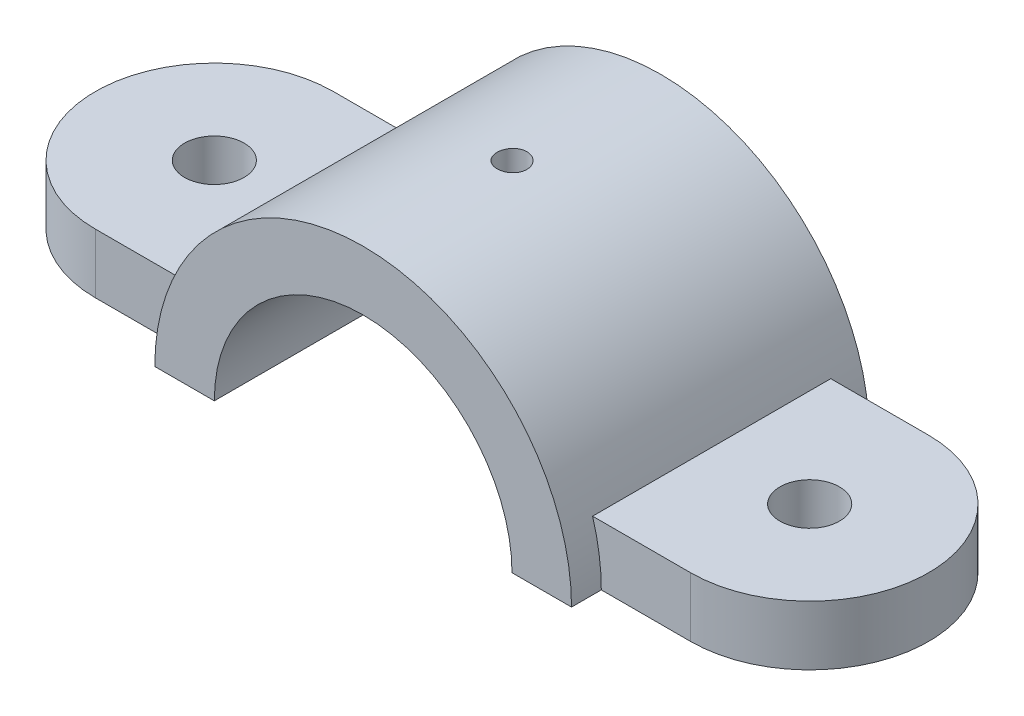
ISO-10303-21;
HEADER;
FILE_DESCRIPTION(('STEP AP214'),'2;1');
FILE_NAME('part.step','',(''),(''),'','','');
FILE_SCHEMA(('AUTOMOTIVE_DESIGN { 1 0 10303 214 1 1 1 1 }'));
ENDSEC;
DATA;
#1=APPLICATION_CONTEXT('core data for automotive mechanical design processes');
#2=APPLICATION_PROTOCOL_DEFINITION('international standard','automotive_design',2000,#1);
#3=PRODUCT_CONTEXT('',#1,'mechanical');
#4=PRODUCT('Part','Part','',(#3));
#5=PRODUCT_RELATED_PRODUCT_CATEGORY('part','',(#4));
#6=PRODUCT_DEFINITION_FORMATION('','',#4);
#7=PRODUCT_DEFINITION_CONTEXT('part definition',#1,'design');
#8=PRODUCT_DEFINITION('design','',#6,#7);
#9=PRODUCT_DEFINITION_SHAPE('','',#8);
#10=(LENGTH_UNIT() NAMED_UNIT(*) SI_UNIT(.MILLI.,.METRE.));
#11=(NAMED_UNIT(*) PLANE_ANGLE_UNIT() SI_UNIT($,.RADIAN.));
#12=(NAMED_UNIT(*) SI_UNIT($,.STERADIAN.) SOLID_ANGLE_UNIT());
#13=UNCERTAINTY_MEASURE_WITH_UNIT(LENGTH_MEASURE(1.E-05),#10,'distance_accuracy_value','');
#14=(GEOMETRIC_REPRESENTATION_CONTEXT(3) GLOBAL_UNCERTAINTY_ASSIGNED_CONTEXT((#13)) GLOBAL_UNIT_ASSIGNED_CONTEXT((#10,
#11,#12)) REPRESENTATION_CONTEXT('',''));
#15=CARTESIAN_POINT('',(0.,0.,0.));
#16=DIRECTION('',(0.,0.,1.));
#17=DIRECTION('',(1.,0.,0.));
#18=AXIS2_PLACEMENT_3D('',#15,#16,#17);
#19=CARTESIAN_POINT('',(0.,0.,31.75));
#20=DIRECTION('',(0.,0.,-1.));
#21=DIRECTION('',(-1.,0.,0.));
#22=AXIS2_PLACEMENT_3D('',#19,#20,#21);
#23=CYLINDRICAL_SURFACE('',#22,44.45);
#24=DIRECTION('',(0.,0.,-1.));
#25=VECTOR('',#24,1.);
#26=CARTESIAN_POINT('',(-42.597094971371,12.7,31.75));
#27=LINE('',#26,#25);
#28=CARTESIAN_POINT('',(-42.597094971371,12.7,25.4));
#29=VERTEX_POINT('',#28);
#30=CARTESIAN_POINT('',(-42.597094971371,12.7,-25.4));
#31=VERTEX_POINT('',#30);
#32=EDGE_CURVE('E169',#29,#31,#27,.T.);
#33=ORIENTED_EDGE('',*,*,#32,.F.);
#34=CARTESIAN_POINT('',(0.,0.,25.4));
#35=DIRECTION('',(0.,0.,-1.));
#36=DIRECTION('',(-1.,0.,0.));
#37=AXIS2_PLACEMENT_3D('',#34,#35,#36);
#38=CIRCLE('',#37,44.45);
#39=CARTESIAN_POINT('',(-44.45,0.,25.4));
#40=VERTEX_POINT('',#39);
#41=EDGE_CURVE('E170',#29,#40,#38,.F.);
#42=ORIENTED_EDGE('',*,*,#41,.T.);
#43=DIRECTION('',(0.,0.,-1.));
#44=VECTOR('',#43,1.);
#45=CARTESIAN_POINT('',(-44.45,0.,31.75));
#46=LINE('',#45,#44);
#47=CARTESIAN_POINT('',(-44.45,0.,31.75));
#48=VERTEX_POINT('',#47);
#49=EDGE_CURVE('E162',#48,#40,#46,.T.);
#50=ORIENTED_EDGE('',*,*,#49,.F.);
#51=CARTESIAN_POINT('',(0.,0.,31.75));
#52=DIRECTION('',(0.,0.,1.));
#53=DIRECTION('',(1.,0.,0.));
#54=AXIS2_PLACEMENT_3D('',#51,#52,#53);
#55=CIRCLE('',#54,44.45);
#56=CARTESIAN_POINT('',(44.45,0.,31.75));
#57=VERTEX_POINT('',#56);
#58=EDGE_CURVE('E153',#57,#48,#55,.T.);
#59=ORIENTED_EDGE('',*,*,#58,.F.);
#60=DIRECTION('',(0.,0.,-1.));
#61=VECTOR('',#60,1.);
#62=CARTESIAN_POINT('',(44.45,0.,31.75));
#63=LINE('',#62,#61);
#64=CARTESIAN_POINT('',(44.45,0.,25.4));
#65=VERTEX_POINT('',#64);
#66=EDGE_CURVE('E157',#57,#65,#63,.T.);
#67=ORIENTED_EDGE('',*,*,#66,.T.);
#68=CARTESIAN_POINT('',(42.597094971371,12.7,25.4));
#69=VERTEX_POINT('',#68);
#70=EDGE_CURVE('E166',#65,#69,#38,.F.);
#71=ORIENTED_EDGE('',*,*,#70,.T.);
#72=DIRECTION('',(0.,0.,-1.));
#73=VECTOR('',#72,1.);
#74=CARTESIAN_POINT('',(42.597094971371,12.7,31.75));
#75=LINE('',#74,#73);
#76=CARTESIAN_POINT('',(42.597094971371,12.7,-25.4));
#77=VERTEX_POINT('',#76);
#78=EDGE_CURVE('E61',#77,#69,#75,.F.);
#79=ORIENTED_EDGE('',*,*,#78,.F.);
#80=CARTESIAN_POINT('',(0.,0.,-25.4));
#81=DIRECTION('',(0.,0.,1.));
#82=DIRECTION('',(1.,0.,0.));
#83=AXIS2_PLACEMENT_3D('',#80,#81,#82);
#84=CIRCLE('',#83,44.45);
#85=CARTESIAN_POINT('',(44.45,0.,-25.4));
#86=VERTEX_POINT('',#85);
#87=EDGE_CURVE('E46',#77,#86,#84,.F.);
#88=ORIENTED_EDGE('',*,*,#87,.T.);
#89=CARTESIAN_POINT('',(44.45,0.,-31.75));
#90=VERTEX_POINT('',#89);
#91=EDGE_CURVE('E161',#86,#90,#63,.T.);
#92=ORIENTED_EDGE('',*,*,#91,.T.);
#93=CARTESIAN_POINT('',(0.,0.,-31.75));
#94=DIRECTION('',(0.,0.,1.));
#95=DIRECTION('',(1.,0.,0.));
#96=AXIS2_PLACEMENT_3D('',#93,#94,#95);
#97=CIRCLE('',#96,44.45);
#98=CARTESIAN_POINT('',(-44.45,0.,-31.75));
#99=VERTEX_POINT('',#98);
#100=EDGE_CURVE('E150',#90,#99,#97,.T.);
#101=ORIENTED_EDGE('',*,*,#100,.T.);
#102=CARTESIAN_POINT('',(-44.45,0.,-25.4));
#103=VERTEX_POINT('',#102);
#104=EDGE_CURVE('E160',#103,#99,#46,.T.);
#105=ORIENTED_EDGE('',*,*,#104,.F.);
#106=EDGE_CURVE('E11',#103,#31,#84,.F.);
#107=ORIENTED_EDGE('',*,*,#106,.T.);
#108=EDGE_LOOP('',(#33,#42,#50,#59,#67,#71,#79,#88,#92,#101,#105,#107));
#109=FACE_BOUND('',#108,.T.);
#110=CARTESIAN_POINT('',(0.,44.45,-3.175));
#111=CARTESIAN_POINT('',(-0.17809755969062,44.4499985010204,-3.1749921852915));
#112=CARTESIAN_POINT('',(-0.356318460938591,44.4489181935322,-3.15996439283335));
#113=CARTESIAN_POINT('',(-0.707835270978346,44.4447124952987,-3.10023344384522));
#114=CARTESIAN_POINT('',(-0.88112526755611,44.4415847492453,-3.05549610954538));
#115=CARTESIAN_POINT('',(-1.217637916744,44.4336378558182,-2.9376410589189));
#116=CARTESIAN_POINT('',(-1.3808659765955,44.4288196263855,-2.86453874264178));
#117=CARTESIAN_POINT('',(-1.69269346722433,44.418033060304,-2.69205484914637));
#118=CARTESIAN_POINT('',(-1.84129615082639,44.4120649802704,-2.59267913359277));
#119=CARTESIAN_POINT('',(-2.11997998340939,44.3996363409005,-2.37026268279305));
#120=CARTESIAN_POINT('',(-2.25002939260178,44.3931749659727,-2.24718222035807));
#121=CARTESIAN_POINT('',(-2.48764317829891,44.380494884107,-1.9809330348178));
#122=CARTESIAN_POINT('',(-2.59520659669311,44.3742761875187,-1.83776345616511));
#123=CARTESIAN_POINT('',(-2.78489768412392,44.3627762652838,-1.53521415441454));
#124=CARTESIAN_POINT('',(-2.86699822922461,44.3574960418693,-1.37581738390363));
#125=CARTESIAN_POINT('',(-3.00325964148284,44.3484793632232,-1.04545759664348));
#126=CARTESIAN_POINT('',(-3.05742088477708,44.3447428872087,-0.874494735639385));
#127=CARTESIAN_POINT('',(-3.13617617440064,44.3392430145078,-0.526167808778249));
#128=CARTESIAN_POINT('',(-3.16082095687461,44.337476232457,-0.348815268475376));
#129=CARTESIAN_POINT('',(-3.18000042163169,44.3361048630515,0.00751738406976795));
#130=CARTESIAN_POINT('',(-3.17453553300968,44.3365002448835,0.186497473081446));
#131=CARTESIAN_POINT('',(-3.1336928080948,44.3394054749584,0.540658150616267));
#132=CARTESIAN_POINT('',(-3.09836996539516,44.3419114358203,0.715845117472152));
#133=CARTESIAN_POINT('',(-2.9988993736118,44.3487493276067,1.05779706955871));
#134=CARTESIAN_POINT('',(-2.93475140879975,44.353081272197,1.22456199174809));
#135=CARTESIAN_POINT('',(-2.7793894028839,44.3630874612053,1.54511214283126));
#136=CARTESIAN_POINT('',(-2.68815052276379,44.3687629365025,1.69888529294486));
#137=CARTESIAN_POINT('',(-2.4812145802267,44.3808154538232,1.98895478384996));
#138=CARTESIAN_POINT('',(-2.36551715598194,44.3871925062249,2.1252508660463));
#139=CARTESIAN_POINT('',(-2.11263912589021,44.3999468565423,2.37681715563405));
#140=CARTESIAN_POINT('',(-1.97541094694941,44.4063241229682,2.49203954889324));
#141=CARTESIAN_POINT('',(-1.68353326582272,44.4183465899756,2.69781856552779));
#142=CARTESIAN_POINT('',(-1.52888375563628,44.4239917902211,2.7883751775756));
#143=CARTESIAN_POINT('',(-1.20652351982175,44.4339147067992,2.94224843922552));
#144=CARTESIAN_POINT('',(-1.03881186894527,44.4381923261505,3.00556315708915));
#145=CARTESIAN_POINT('',(-0.695101534536753,44.4448968658532,3.10312281529963));
#146=CARTESIAN_POINT('',(-0.519102977405437,44.4473238144234,3.13736819889142));
#147=CARTESIAN_POINT('',(-0.164229470601715,44.4500499204039,3.17575756562762));
#148=CARTESIAN_POINT('',(0.0146382961204224,44.4503537489791,3.17996763115629));
#149=CARTESIAN_POINT('',(0.37053732156954,44.4488118249658,3.15833969363807));
#150=CARTESIAN_POINT('',(0.547568592818349,44.4469660870436,3.13250189560342));
#151=CARTESIAN_POINT('',(0.894582312960257,44.4413357347358,3.05156640913193));
#152=CARTESIAN_POINT('',(1.06457189733486,44.4375531376683,2.99649916218024));
#153=CARTESIAN_POINT('',(1.39289741703371,44.4284743676534,2.85869891892337));
#154=CARTESIAN_POINT('',(1.55123321591261,44.423178176988,2.77596559875992));
#155=CARTESIAN_POINT('',(1.85205847074147,44.4116551142492,2.58501432949461));
#156=CARTESIAN_POINT('',(1.99451993838108,44.4054266423692,2.47675238551611));
#157=CARTESIAN_POINT('',(2.25927051769905,44.3927448859707,2.23788087230796));
#158=CARTESIAN_POINT('',(2.38155937133056,44.3862915985778,2.10727101724873));
#159=CARTESIAN_POINT('',(2.60271836127947,44.3738738792979,1.8271254531647));
#160=CARTESIAN_POINT('',(2.70154552685789,44.3679103572931,1.67755577532192));
#161=CARTESIAN_POINT('',(2.87268159958821,44.3571593354335,1.36390636365056));
#162=CARTESIAN_POINT('',(2.94499071056566,44.3523718265397,1.19982674136168));
#163=CARTESIAN_POINT('',(3.06096414564601,44.3445193603726,0.86197011910641));
#164=CARTESIAN_POINT('',(3.10465522282775,44.3414527946903,0.688202341357347));
#165=CARTESIAN_POINT('',(3.16223963020726,44.3373836261545,0.335774660840803));
#166=CARTESIAN_POINT('',(3.17613336446706,44.3363809953135,0.157114824444559));
#167=CARTESIAN_POINT('',(3.17372453217149,44.3365534587745,-0.199598343740228));
#168=CARTESIAN_POINT('',(3.15748950229105,44.3377236824066,-0.377652137869704));
#169=CARTESIAN_POINT('',(3.09542433897,44.3420996628091,-0.72849816555522));
#170=CARTESIAN_POINT('',(3.04959415484711,44.3453054230655,-0.901290390100189));
#171=CARTESIAN_POINT('',(2.92965566407163,44.3533900104309,-1.23671606520818));
#172=CARTESIAN_POINT('',(2.85554804081303,44.3582687971069,-1.39934976116655));
#173=CARTESIAN_POINT('',(2.68116669252534,44.3691496822712,-1.70987682459985));
#174=CARTESIAN_POINT('',(2.58089353963295,44.375151756197,-1.85777051428274));
#175=CARTESIAN_POINT('',(2.35677531436749,44.3876187401926,-2.13496369125892));
#176=CARTESIAN_POINT('',(2.23288076532297,44.3940846036465,-2.26422313162537));
#177=CARTESIAN_POINT('',(1.96511570862738,44.4067421131503,-2.50015779397603));
#178=CARTESIAN_POINT('',(1.82124034274249,44.412933692025,-2.60682750740843));
#179=CARTESIAN_POINT('',(1.51738984886767,44.4243532343972,-2.79465826526877));
#180=CARTESIAN_POINT('',(1.35739121739497,44.429579758747,-2.87578133807944));
#181=CARTESIAN_POINT('',(1.02612043812863,44.4384621486734,-3.00991083117564));
#182=CARTESIAN_POINT('',(0.854861659530852,44.4421198394355,-3.0629499413693));
#183=CARTESIAN_POINT('',(0.568807958256338,44.4465015797572,-3.12572942626644));
#184=CARTESIAN_POINT('',(0.455858555116114,44.4478076013163,-3.1441817392464));
#185=CARTESIAN_POINT('',(0.228623044805803,44.4495572918002,-3.16881952317773));
#186=CARTESIAN_POINT('',(0.114336940124904,44.4500009623306,-3.17500501696856));
#187=CARTESIAN_POINT('',(0.,44.45,-3.175));
#188=B_SPLINE_CURVE_WITH_KNOTS('',3,(#110,#111,#112,#113,#114,#115,#116,#117,#118,#119,#120,
#121,#122,#123,#124,#125,#126,#127,#128,#129,#130,#131,#132,#133,#134,#135,#136,#137,#138,#139,
#140,#141,#142,#143,#144,#145,#146,#147,#148,#149,#150,#151,#152,#153,#154,#155,#156,#157,#158,
#159,#160,#161,#162,#163,#164,#165,#166,#167,#168,#169,#170,#171,#172,#173,#174,#175,#176,#177,
#178,#179,#180,#181,#182,#183,#184,#185,#186,#187),.UNSPECIFIED.,.T.,.F.,(4,2,2,2,2,2,2,2,2,2,2,
2,2,2,2,2,2,2,2,2,2,2,2,2,2,2,2,2,2,2,2,2,2,2,2,2,2,2,4),(0.,0.53387525923504,1.06836575339372,
1.60256646458327,2.13664809461002,2.67163271481405,3.20664012565185,3.74221550288008,
4.27778366966298,4.81242991554012,5.34706854215868,5.88072458989979,6.41438463160985,
6.94853549244862,7.48269425580818,8.01805033204645,8.55340665414211,9.08880093241043,
9.62418704691905,10.1583948641756,10.6925990366306,11.2262479419403,11.7599030943476,
12.2944847333891,12.8290732102362,13.3646333747321,13.9001894226693,14.4352440979472,
14.9702915176575,15.5041410228642,16.0379914423009,16.571828960744,17.105654807249,
17.6406113237351,18.1756981406486,18.7115765781027,19.2468298707823,19.5895733497411,
19.9323161905491),.UNSPECIFIED.);
#189=CARTESIAN_POINT('',(0.,44.45,-3.175));
#190=VERTEX_POINT('',#189);
#191=EDGE_CURVE('E233',#190,#190,#188,.T.);
#192=ORIENTED_EDGE('',*,*,#191,.F.);
#193=EDGE_LOOP('',(#192));
#194=FACE_BOUND('',#193,.T.);
#195=ADVANCED_FACE('F33',(#109,#194),#23,.T.);
#196=CARTESIAN_POINT('',(0.,0.,-31.75));
#197=DIRECTION('',(0.,0.,1.));
#198=DIRECTION('',(1.,0.,0.));
#199=AXIS2_PLACEMENT_3D('',#196,#197,#198);
#200=CYLINDRICAL_SURFACE('',#199,31.75);
#201=CARTESIAN_POINT('',(0.,0.,-31.75));
#202=DIRECTION('',(0.,0.,1.));
#203=DIRECTION('',(1.,0.,0.));
#204=AXIS2_PLACEMENT_3D('',#201,#202,#203);
#205=CIRCLE('',#204,31.75);
#206=CARTESIAN_POINT('',(31.75,0.,-31.75));
#207=VERTEX_POINT('',#206);
#208=CARTESIAN_POINT('',(-31.75,0.,-31.75));
#209=VERTEX_POINT('',#208);
#210=EDGE_CURVE('E125',#207,#209,#205,.T.);
#211=ORIENTED_EDGE('',*,*,#210,.F.);
#212=DIRECTION('',(0.,0.,1.));
#213=VECTOR('',#212,1.);
#214=CARTESIAN_POINT('',(31.75,0.,-31.75));
#215=LINE('',#214,#213);
#216=CARTESIAN_POINT('',(31.75,0.,31.75));
#217=VERTEX_POINT('',#216);
#218=EDGE_CURVE('E129',#217,#207,#215,.F.);
#219=ORIENTED_EDGE('',*,*,#218,.F.);
#220=CARTESIAN_POINT('',(0.,0.,31.75));
#221=DIRECTION('',(0.,0.,1.));
#222=DIRECTION('',(1.,0.,0.));
#223=AXIS2_PLACEMENT_3D('',#220,#221,#222);
#224=CIRCLE('',#223,31.75);
#225=CARTESIAN_POINT('',(-31.75,0.,31.75));
#226=VERTEX_POINT('',#225);
#227=EDGE_CURVE('E135',#217,#226,#224,.T.);
#228=ORIENTED_EDGE('',*,*,#227,.T.);
#229=DIRECTION('',(0.,0.,1.));
#230=VECTOR('',#229,1.);
#231=CARTESIAN_POINT('',(-31.75,0.,-31.75));
#232=LINE('',#231,#230);
#233=EDGE_CURVE('E53',#209,#226,#232,.T.);
#234=ORIENTED_EDGE('',*,*,#233,.F.);
#235=EDGE_LOOP('',(#211,#219,#228,#234));
#236=FACE_BOUND('',#235,.T.);
#237=CARTESIAN_POINT('',(0.,31.75,-3.175));
#238=CARTESIAN_POINT('',(0.177864623288194,31.7499979527844,-3.17499229776629));
#239=CARTESIAN_POINT('',(0.35584684090768,31.7484895126795,-3.16000362125379));
#240=CARTESIAN_POINT('',(0.706876915227458,31.7426170961329,-3.10043712432789));
#241=CARTESIAN_POINT('',(0.879919116361029,31.7382499737803,-3.05582670512193));
#242=CARTESIAN_POINT('',(1.21593506956459,31.7271531623775,-2.93832838610188));
#243=CARTESIAN_POINT('',(1.37891483365234,31.7204249004225,-2.86545756435384));
#244=CARTESIAN_POINT('',(1.69029431104929,31.7053581472692,-2.69354011731703));
#245=CARTESIAN_POINT('',(1.83869691562357,31.6970199763607,-2.59449869719956));
#246=CARTESIAN_POINT('',(2.11727907339021,31.679633882837,-2.37266893492228));
#247=CARTESIAN_POINT('',(2.24739880985078,31.6705837749702,-2.24980563689854));
#248=CARTESIAN_POINT('',(2.48520750554338,31.6528118817738,-1.98397960371488));
#249=CARTESIAN_POINT('',(2.59289542723742,31.6440901116461,-1.84101593936542));
#250=CARTESIAN_POINT('',(2.78299535615848,31.6279400318009,-1.5386731619045));
#251=CARTESIAN_POINT('',(2.86535325281924,31.6205145055712,-1.37925986499882));
#252=CARTESIAN_POINT('',(3.00210977155826,31.6078246921021,-1.04878001475169));
#253=CARTESIAN_POINT('',(3.05650908442735,31.6025603514655,-0.877713749445958));
#254=CARTESIAN_POINT('',(3.13562695708601,31.594808669317,-0.529393782250418));
#255=CARTESIAN_POINT('',(3.16044469828705,31.5923120501396,-0.352162818494237));
#256=CARTESIAN_POINT('',(3.18000153030477,31.5903496671717,0.00396514128160491));
#257=CARTESIAN_POINT('',(3.17474141171479,31.5908838237177,0.18286209338754));
#258=CARTESIAN_POINT('',(3.13437358980225,31.5949141690412,0.536560108276288));
#259=CARTESIAN_POINT('',(3.09937418009545,31.5983996107532,0.711373670368606));
#260=CARTESIAN_POINT('',(3.00068978267811,31.6079230136255,1.05263303316348));
#261=CARTESIAN_POINT('',(2.93700440746199,31.6139610092671,1.21907872079448));
#262=CARTESIAN_POINT('',(2.78263633807378,31.6279215501032,1.53921963967397));
#263=CARTESIAN_POINT('',(2.69190559763593,31.635847444084,1.69289155162858));
#264=CARTESIAN_POINT('',(2.4860568368465,31.6526878925189,1.98286755734523));
#265=CARTESIAN_POINT('',(2.3709381027184,31.6616024759059,2.1191711425921));
#266=CARTESIAN_POINT('',(2.11897630690832,31.6794637336874,2.37117062591516));
#267=CARTESIAN_POINT('',(1.98203972035308,31.6884103763227,2.48677303597156));
#268=CARTESIAN_POINT('',(1.69065410451533,31.705290573243,2.69336403449048));
#269=CARTESIAN_POINT('',(1.53620505559873,31.7132241263921,2.78435259535681));
#270=CARTESIAN_POINT('',(1.21411398557326,31.7271868524303,2.93912931448505));
#271=CARTESIAN_POINT('',(1.04646966978794,31.7332156931689,3.00291272929735));
#272=CARTESIAN_POINT('',(0.702777415022532,31.7426863062647,3.10140006055981));
#273=CARTESIAN_POINT('',(0.526729727515704,31.7461281559868,3.13610484662023));
#274=CARTESIAN_POINT('',(0.172037689616792,31.7500270404689,3.17533117705788));
#275=CARTESIAN_POINT('',(-0.00659225918493939,31.7504968325006,3.17998172820168));
#276=CARTESIAN_POINT('',(-0.362089043777349,31.7484328757783,3.15930640982017));
#277=CARTESIAN_POINT('',(-0.538955903354994,31.7458991676019,3.13398094527398));
#278=CARTESIAN_POINT('',(-0.885533556700094,31.7381211038694,3.05417951703649));
#279=CARTESIAN_POINT('',(-1.05525839548616,31.7328823658977,2.99976395703231));
#280=CARTESIAN_POINT('',(-1.38317072039351,31.7202819638243,2.86338907243166));
#281=CARTESIAN_POINT('',(-1.54135794774885,31.7129202521268,2.78142913029991));
#282=CARTESIAN_POINT('',(-1.84228797204655,31.6968655917409,2.59197208724207));
#283=CARTESIAN_POINT('',(-1.98497716970281,31.6881682594093,2.48439022766053));
#284=CARTESIAN_POINT('',(-2.25031815401521,31.6704323686073,2.24686473492255));
#285=CARTESIAN_POINT('',(-2.37296943759614,31.6613938015768,2.11692054050174));
#286=CARTESIAN_POINT('',(-2.59520089889169,31.643955766469,1.83779612545767));
#287=CARTESIAN_POINT('',(-2.69469640980755,31.6355587169125,1.68854832297717));
#288=CARTESIAN_POINT('',(-2.86720997151165,31.6203911806332,1.37538663153427));
#289=CARTESIAN_POINT('',(-2.94022838437108,31.6136206716682,1.21147294316434));
#290=CARTESIAN_POINT('',(-3.05757328757321,31.6024878373811,0.873922752196101));
#291=CARTESIAN_POINT('',(-3.10195015502766,31.5981212857808,0.700303907710689));
#292=CARTESIAN_POINT('',(-3.16091572263604,31.5922775977313,0.348033346474546));
#293=CARTESIAN_POINT('',(-3.17550527711847,31.5908003784134,0.169381774216232));
#294=CARTESIAN_POINT('',(-3.17447021464624,31.5909043411651,-0.18704143553254));
#295=CARTESIAN_POINT('',(-3.15897859945813,31.5924720602625,-0.364813478152941));
#296=CARTESIAN_POINT('',(-3.0984998131596,31.5984605484931,-0.715216112009317));
#297=CARTESIAN_POINT('',(-3.05351260886986,31.6028813208356,-0.887846697461487));
#298=CARTESIAN_POINT('',(-2.93535635399457,31.6140740673562,-1.22306508322695));
#299=CARTESIAN_POINT('',(-2.86219120328241,31.6208457161565,-1.38565426967438));
#300=CARTESIAN_POINT('',(-2.68976968684256,31.6359778708996,-1.69626563105554));
#301=CARTESIAN_POINT('',(-2.59051346722094,31.6443383679452,-1.8442878875555));
#302=CARTESIAN_POINT('',(-2.36822791620593,31.6617504689079,-2.1222451664484));
#303=CARTESIAN_POINT('',(-2.2450994877266,31.6708048550743,-2.2521007674655));
#304=CARTESIAN_POINT('',(-1.97876064503972,31.6885591376389,-2.48936583882141));
#305=CARTESIAN_POINT('',(-1.83554542754371,31.6972589486045,-2.59676992505901));
#306=CARTESIAN_POINT('',(-1.53270405346209,31.7133465956959,-2.78629571598842));
#307=CARTESIAN_POINT('',(-1.37303747917597,31.7207310728513,-2.86835307375096));
#308=CARTESIAN_POINT('',(-1.04222003614425,31.7333194786842,-3.00438319246578));
#309=CARTESIAN_POINT('',(-0.871082363196308,31.7385258646315,-3.05838761877751));
#310=CARTESIAN_POINT('',(-0.58247997996311,31.744863287316,-3.12331295924425));
#311=CARTESIAN_POINT('',(-0.466860105281314,31.7467805719657,-3.14266911565046));
#312=CARTESIAN_POINT('',(-0.234177144094968,31.7493495996875,-3.16851514524609));
#313=CARTESIAN_POINT('',(-0.117114063544321,31.7500013479788,-3.17500507149691));
#314=CARTESIAN_POINT('',(0.,31.75,-3.175));
#315=B_SPLINE_CURVE_WITH_KNOTS('',3,(#237,#238,#239,#240,#241,#242,#243,#244,#245,#246,#247,
#248,#249,#250,#251,#252,#253,#254,#255,#256,#257,#258,#259,#260,#261,#262,#263,#264,#265,#266,
#267,#268,#269,#270,#271,#272,#273,#274,#275,#276,#277,#278,#279,#280,#281,#282,#283,#284,#285,
#286,#287,#288,#289,#290,#291,#292,#293,#294,#295,#296,#297,#298,#299,#300,#301,#302,#303,#304,
#305,#306,#307,#308,#309,#310,#311,#312,#313,#314),.UNSPECIFIED.,.T.,.F.,(4,2,2,2,2,2,2,2,2,2,2,
2,2,2,2,2,2,2,2,2,2,2,2,2,2,2,2,2,2,2,2,2,2,2,2,2,2,2,4),(0.,0.533166212902404,1.06692015100267,
1.60035203719974,2.13367790682533,2.66870995537785,3.20376674525741,3.73995872124304,
4.2761374485495,4.81051336743499,5.34487524037091,5.87729956875526,6.40973108963187,
6.94311417358941,7.47651287051323,8.01226281072956,8.54801335160776,9.08385726702121,
9.61968515719521,10.1532114882963,10.6867306114828,11.2191461955942,11.7515737170706,
12.2857876187712,12.8200149304748,13.356165934573,13.8923096065931,14.4275076763279,
14.9626903958568,15.4955122300831,16.0283346636768,16.5610833802689,17.093829113612,
17.628835628328,18.1639702962234,18.7004525350832,19.2363278847506,19.5873899346271,
19.9384505366916),.UNSPECIFIED.);
#316=CARTESIAN_POINT('',(0.,31.75,-3.175));
#317=VERTEX_POINT('',#316);
#318=EDGE_CURVE('E37',#317,#317,#315,.T.);
#319=ORIENTED_EDGE('',*,*,#318,.F.);
#320=EDGE_LOOP('',(#319));
#321=FACE_BOUND('',#320,.T.);
#322=ADVANCED_FACE('F127',(#236,#321),#200,.F.);
#323=CARTESIAN_POINT('',(-63.5,0.,0.));
#324=DIRECTION('',(0.,1.,0.));
#325=DIRECTION('',(0.,0.,1.));
#326=AXIS2_PLACEMENT_3D('',#323,#324,#325);
#327=PLANE('',#326);
#328=CARTESIAN_POINT('',(-63.5,0.,0.));
#329=DIRECTION('',(0.,1.,0.));
#330=DIRECTION('',(0.,0.,1.));
#331=AXIS2_PLACEMENT_3D('',#328,#329,#330);
#332=CIRCLE('',#331,6.35);
#333=CARTESIAN_POINT('',(-63.5,0.,6.35));
#334=VERTEX_POINT('',#333);
#335=EDGE_CURVE('E175',#334,#334,#332,.T.);
#336=ORIENTED_EDGE('',*,*,#335,.T.);
#337=EDGE_LOOP('',(#336));
#338=FACE_BOUND('',#337,.T.);
#339=DIRECTION('',(1.,0.,0.));
#340=VECTOR('',#339,1.);
#341=CARTESIAN_POINT('',(-44.45,0.,-31.75));
#342=LINE('',#341,#340);
#343=EDGE_CURVE('E151',#99,#209,#342,.T.);
#344=ORIENTED_EDGE('',*,*,#343,.T.);
#345=ORIENTED_EDGE('',*,*,#233,.T.);
#346=DIRECTION('',(1.,0.,0.));
#347=VECTOR('',#346,1.);
#348=CARTESIAN_POINT('',(-44.45,0.,31.75));
#349=LINE('',#348,#347);
#350=EDGE_CURVE('E226',#48,#226,#349,.T.);
#351=ORIENTED_EDGE('',*,*,#350,.F.);
#352=ORIENTED_EDGE('',*,*,#49,.T.);
#353=DIRECTION('',(1.,0.,0.));
#354=VECTOR('',#353,1.);
#355=CARTESIAN_POINT('',(-63.5,0.,25.4));
#356=LINE('',#355,#354);
#357=CARTESIAN_POINT('',(-63.5,0.,25.4));
#358=VERTEX_POINT('',#357);
#359=EDGE_CURVE('E202',#358,#40,#356,.T.);
#360=ORIENTED_EDGE('',*,*,#359,.F.);
#361=CARTESIAN_POINT('',(-63.5,0.,0.));
#362=DIRECTION('',(0.,1.,0.));
#363=DIRECTION('',(0.,0.,1.));
#364=AXIS2_PLACEMENT_3D('',#361,#362,#363);
#365=CIRCLE('',#364,25.4);
#366=CARTESIAN_POINT('',(-63.5,0.,-25.4));
#367=VERTEX_POINT('',#366);
#368=EDGE_CURVE('E182',#367,#358,#365,.T.);
#369=ORIENTED_EDGE('',*,*,#368,.F.);
#370=DIRECTION('',(-1.,0.,0.));
#371=VECTOR('',#370,1.);
#372=CARTESIAN_POINT('',(-63.5,0.,-25.4));
#373=LINE('',#372,#371);
#374=EDGE_CURVE('E206',#103,#367,#373,.T.);
#375=ORIENTED_EDGE('',*,*,#374,.F.);
#376=ORIENTED_EDGE('',*,*,#104,.T.);
#377=EDGE_LOOP('',(#344,#345,#351,#352,#360,#369,#375,#376));
#378=FACE_BOUND('',#377,.T.);
#379=ADVANCED_FACE('F250',(#338,#378),#327,.F.);
#380=CARTESIAN_POINT('',(-63.5,12.7,0.));
#381=DIRECTION('',(0.,1.,0.));
#382=DIRECTION('',(0.,0.,1.));
#383=AXIS2_PLACEMENT_3D('',#380,#381,#382);
#384=PLANE('',#383);
#385=CARTESIAN_POINT('',(63.5,12.7,0.));
#386=DIRECTION('',(0.,1.,0.));
#387=DIRECTION('',(0.,0.,1.));
#388=AXIS2_PLACEMENT_3D('',#385,#386,#387);
#389=CIRCLE('',#388,6.35);
#390=CARTESIAN_POINT('',(63.5,12.7,6.35));
#391=VERTEX_POINT('',#390);
#392=EDGE_CURVE('E172',#391,#391,#389,.T.);
#393=ORIENTED_EDGE('',*,*,#392,.F.);
#394=EDGE_LOOP('',(#393));
#395=FACE_BOUND('',#394,.T.);
#396=DIRECTION('',(-1.,0.,0.));
#397=VECTOR('',#396,1.);
#398=CARTESIAN_POINT('',(-63.5,12.7,-25.4));
#399=LINE('',#398,#397);
#400=CARTESIAN_POINT('',(63.5,12.7,-25.4));
#401=VERTEX_POINT('',#400);
#402=EDGE_CURVE('E196',#401,#77,#399,.T.);
#403=ORIENTED_EDGE('',*,*,#402,.T.);
#404=ORIENTED_EDGE('',*,*,#78,.T.);
#405=DIRECTION('',(1.,0.,0.));
#406=VECTOR('',#405,1.);
#407=CARTESIAN_POINT('',(-63.5,12.7,25.4));
#408=LINE('',#407,#406);
#409=CARTESIAN_POINT('',(63.5,12.7,25.4));
#410=VERTEX_POINT('',#409);
#411=EDGE_CURVE('E188',#69,#410,#408,.T.);
#412=ORIENTED_EDGE('',*,*,#411,.T.);
#413=CARTESIAN_POINT('',(63.5,12.7,0.));
#414=DIRECTION('',(0.,1.,0.));
#415=DIRECTION('',(0.,0.,1.));
#416=AXIS2_PLACEMENT_3D('',#413,#414,#415);
#417=CIRCLE('',#416,25.4);
#418=EDGE_CURVE('E193',#410,#401,#417,.T.);
#419=ORIENTED_EDGE('',*,*,#418,.T.);
#420=EDGE_LOOP('',(#403,#404,#412,#419));
#421=FACE_BOUND('',#420,.T.);
#422=ADVANCED_FACE('F271',(#395,#421),#384,.T.);
#423=CARTESIAN_POINT('',(-63.5,12.7,0.));
#424=DIRECTION('',(0.,1.,0.));
#425=DIRECTION('',(0.,0.,1.));
#426=AXIS2_PLACEMENT_3D('',#423,#424,#425);
#427=CIRCLE('',#426,6.35);
#428=CARTESIAN_POINT('',(-63.5,12.7,6.35));
#429=VERTEX_POINT('',#428);
#430=EDGE_CURVE('E179',#429,#429,#427,.T.);
#431=ORIENTED_EDGE('',*,*,#430,.F.);
#432=EDGE_LOOP('',(#431));
#433=FACE_BOUND('',#432,.T.);
#434=CARTESIAN_POINT('',(-63.5,12.7,25.4));
#435=VERTEX_POINT('',#434);
#436=EDGE_CURVE('E190',#435,#29,#408,.T.);
#437=ORIENTED_EDGE('',*,*,#436,.T.);
#438=ORIENTED_EDGE('',*,*,#32,.T.);
#439=CARTESIAN_POINT('',(-63.5,12.7,-25.4));
#440=VERTEX_POINT('',#439);
#441=EDGE_CURVE('E195',#31,#440,#399,.T.);
#442=ORIENTED_EDGE('',*,*,#441,.T.);
#443=CARTESIAN_POINT('',(-63.5,12.7,0.));
#444=DIRECTION('',(0.,1.,0.));
#445=DIRECTION('',(0.,0.,1.));
#446=AXIS2_PLACEMENT_3D('',#443,#444,#445);
#447=CIRCLE('',#446,25.4);
#448=EDGE_CURVE('E185',#440,#435,#447,.T.);
#449=ORIENTED_EDGE('',*,*,#448,.T.);
#450=EDGE_LOOP('',(#437,#438,#442,#449));
#451=FACE_BOUND('',#450,.T.);
#452=ADVANCED_FACE('F281',(#433,#451),#384,.T.);
#453=CARTESIAN_POINT('',(-63.5,12.7,25.4));
#454=DIRECTION('',(0.,0.,-1.));
#455=DIRECTION('',(-1.,0.,0.));
#456=AXIS2_PLACEMENT_3D('',#453,#454,#455);
#457=PLANE('',#456);
#458=ORIENTED_EDGE('',*,*,#70,.F.);
#459=CARTESIAN_POINT('',(63.5,0.,25.4));
#460=VERTEX_POINT('',#459);
#461=EDGE_CURVE('E201',#65,#460,#356,.T.);
#462=ORIENTED_EDGE('',*,*,#461,.T.);
#463=DIRECTION('',(0.,-1.,0.));
#464=VECTOR('',#463,1.);
#465=CARTESIAN_POINT('',(63.5,12.7,25.4));
#466=LINE('',#465,#464);
#467=EDGE_CURVE('E213',#410,#460,#466,.T.);
#468=ORIENTED_EDGE('',*,*,#467,.F.);
#469=ORIENTED_EDGE('',*,*,#411,.F.);
#470=EDGE_LOOP('',(#458,#462,#468,#469));
#471=FACE_BOUND('',#470,.T.);
#472=ADVANCED_FACE('F290',(#471),#457,.F.);
#473=ORIENTED_EDGE('',*,*,#41,.F.);
#474=ORIENTED_EDGE('',*,*,#436,.F.);
#475=DIRECTION('',(0.,-1.,0.));
#476=VECTOR('',#475,1.);
#477=CARTESIAN_POINT('',(-63.5,12.7,25.4));
#478=LINE('',#477,#476);
#479=EDGE_CURVE('E216',#435,#358,#478,.T.);
#480=ORIENTED_EDGE('',*,*,#479,.T.);
#481=ORIENTED_EDGE('',*,*,#359,.T.);
#482=EDGE_LOOP('',(#473,#474,#480,#481));
#483=FACE_BOUND('',#482,.T.);
#484=ADVANCED_FACE('F297',(#483),#457,.F.);
#485=CARTESIAN_POINT('',(-63.5,12.7,-25.4));
#486=DIRECTION('',(0.,0.,1.));
#487=DIRECTION('',(1.,0.,0.));
#488=AXIS2_PLACEMENT_3D('',#485,#486,#487);
#489=PLANE('',#488);
#490=ORIENTED_EDGE('',*,*,#106,.F.);
#491=ORIENTED_EDGE('',*,*,#374,.T.);
#492=DIRECTION('',(0.,-1.,0.));
#493=VECTOR('',#492,1.);
#494=CARTESIAN_POINT('',(-63.5,12.7,-25.4));
#495=LINE('',#494,#493);
#496=EDGE_CURVE('E198',#440,#367,#495,.T.);
#497=ORIENTED_EDGE('',*,*,#496,.F.);
#498=ORIENTED_EDGE('',*,*,#441,.F.);
#499=EDGE_LOOP('',(#490,#491,#497,#498));
#500=FACE_BOUND('',#499,.T.);
#501=ADVANCED_FACE('F304',(#500),#489,.F.);
#502=ORIENTED_EDGE('',*,*,#87,.F.);
#503=ORIENTED_EDGE('',*,*,#402,.F.);
#504=DIRECTION('',(0.,-1.,0.));
#505=VECTOR('',#504,1.);
#506=CARTESIAN_POINT('',(63.5,12.7,-25.4));
#507=LINE('',#506,#505);
#508=CARTESIAN_POINT('',(63.5,0.,-25.4));
#509=VERTEX_POINT('',#508);
#510=EDGE_CURVE('E210',#401,#509,#507,.T.);
#511=ORIENTED_EDGE('',*,*,#510,.T.);
#512=EDGE_CURVE('E189',#509,#86,#373,.T.);
#513=ORIENTED_EDGE('',*,*,#512,.T.);
#514=EDGE_LOOP('',(#502,#503,#511,#513));
#515=FACE_BOUND('',#514,.T.);
#516=ADVANCED_FACE('F311',(#515),#489,.F.);
#517=EDGE_CURVE('E145',#217,#57,#349,.T.);
#518=ORIENTED_EDGE('',*,*,#517,.F.);
#519=ORIENTED_EDGE('',*,*,#218,.T.);
#520=EDGE_CURVE('E142',#207,#90,#342,.T.);
#521=ORIENTED_EDGE('',*,*,#520,.T.);
#522=ORIENTED_EDGE('',*,*,#91,.F.);
#523=ORIENTED_EDGE('',*,*,#512,.F.);
#524=CARTESIAN_POINT('',(63.5,0.,0.));
#525=DIRECTION('',(0.,1.,0.));
#526=DIRECTION('',(0.,0.,1.));
#527=AXIS2_PLACEMENT_3D('',#524,#525,#526);
#528=CIRCLE('',#527,25.4);
#529=EDGE_CURVE('E204',#460,#509,#528,.T.);
#530=ORIENTED_EDGE('',*,*,#529,.F.);
#531=ORIENTED_EDGE('',*,*,#461,.F.);
#532=ORIENTED_EDGE('',*,*,#66,.F.);
#533=EDGE_LOOP('',(#518,#519,#521,#522,#523,#530,#531,#532));
#534=FACE_BOUND('',#533,.T.);
#535=CARTESIAN_POINT('',(63.5,0.,0.));
#536=DIRECTION('',(0.,1.,0.));
#537=DIRECTION('',(0.,0.,1.));
#538=AXIS2_PLACEMENT_3D('',#535,#536,#537);
#539=CIRCLE('',#538,6.35);
#540=CARTESIAN_POINT('',(63.5,0.,6.35));
#541=VERTEX_POINT('',#540);
#542=EDGE_CURVE('E176',#541,#541,#539,.T.);
#543=ORIENTED_EDGE('',*,*,#542,.T.);
#544=EDGE_LOOP('',(#543));
#545=FACE_BOUND('',#544,.T.);
#546=ADVANCED_FACE('F139',(#534,#545),#327,.F.);
#547=CARTESIAN_POINT('',(-63.5,12.7,0.));
#548=DIRECTION('',(0.,-1.,0.));
#549=DIRECTION('',(0.,0.,-1.));
#550=AXIS2_PLACEMENT_3D('',#547,#548,#549);
#551=CYLINDRICAL_SURFACE('',#550,25.4);
#552=ORIENTED_EDGE('',*,*,#368,.T.);
#553=ORIENTED_EDGE('',*,*,#479,.F.);
#554=ORIENTED_EDGE('',*,*,#448,.F.);
#555=ORIENTED_EDGE('',*,*,#496,.T.);
#556=EDGE_LOOP('',(#552,#553,#554,#555));
#557=FACE_BOUND('',#556,.T.);
#558=ADVANCED_FACE('F35',(#557),#551,.T.);
#559=CARTESIAN_POINT('',(63.5,12.7,0.));
#560=DIRECTION('',(0.,-1.,0.));
#561=DIRECTION('',(0.,0.,-1.));
#562=AXIS2_PLACEMENT_3D('',#559,#560,#561);
#563=CYLINDRICAL_SURFACE('',#562,25.4);
#564=ORIENTED_EDGE('',*,*,#529,.T.);
#565=ORIENTED_EDGE('',*,*,#510,.F.);
#566=ORIENTED_EDGE('',*,*,#418,.F.);
#567=ORIENTED_EDGE('',*,*,#467,.T.);
#568=EDGE_LOOP('',(#564,#565,#566,#567));
#569=FACE_BOUND('',#568,.T.);
#570=ADVANCED_FACE('F328',(#569),#563,.T.);
#571=CARTESIAN_POINT('',(-63.5,12.7,0.));
#572=DIRECTION('',(0.,-1.,0.));
#573=DIRECTION('',(0.,0.,-1.));
#574=AXIS2_PLACEMENT_3D('',#571,#572,#573);
#575=CYLINDRICAL_SURFACE('',#574,6.35);
#576=ORIENTED_EDGE('',*,*,#430,.T.);
#577=EDGE_LOOP('',(#576));
#578=FACE_BOUND('',#577,.T.);
#579=ORIENTED_EDGE('',*,*,#335,.F.);
#580=EDGE_LOOP('',(#579));
#581=FACE_BOUND('',#580,.T.);
#582=ADVANCED_FACE('F335',(#578,#581),#575,.F.);
#583=CARTESIAN_POINT('',(63.5,12.7,0.));
#584=DIRECTION('',(0.,-1.,0.));
#585=DIRECTION('',(0.,0.,-1.));
#586=AXIS2_PLACEMENT_3D('',#583,#584,#585);
#587=CYLINDRICAL_SURFACE('',#586,6.35);
#588=ORIENTED_EDGE('',*,*,#392,.T.);
#589=EDGE_LOOP('',(#588));
#590=FACE_BOUND('',#589,.T.);
#591=ORIENTED_EDGE('',*,*,#542,.F.);
#592=EDGE_LOOP('',(#591));
#593=FACE_BOUND('',#592,.T.);
#594=ADVANCED_FACE('F253',(#590,#593),#587,.F.);
#595=CARTESIAN_POINT('',(0.,0.,31.75));
#596=DIRECTION('',(0.,0.,1.));
#597=DIRECTION('',(1.,0.,0.));
#598=AXIS2_PLACEMENT_3D('',#595,#596,#597);
#599=PLANE('',#598);
#600=ORIENTED_EDGE('',*,*,#227,.F.);
#601=ORIENTED_EDGE('',*,*,#517,.T.);
#602=ORIENTED_EDGE('',*,*,#58,.T.);
#603=ORIENTED_EDGE('',*,*,#350,.T.);
#604=EDGE_LOOP('',(#600,#601,#602,#603));
#605=FACE_BOUND('',#604,.T.);
#606=ADVANCED_FACE('F251',(#605),#599,.T.);
#607=CARTESIAN_POINT('',(0.,0.,-31.75));
#608=DIRECTION('',(0.,0.,1.));
#609=DIRECTION('',(1.,0.,0.));
#610=AXIS2_PLACEMENT_3D('',#607,#608,#609);
#611=PLANE('',#610);
#612=ORIENTED_EDGE('',*,*,#520,.F.);
#613=ORIENTED_EDGE('',*,*,#210,.T.);
#614=ORIENTED_EDGE('',*,*,#343,.F.);
#615=ORIENTED_EDGE('',*,*,#100,.F.);
#616=EDGE_LOOP('',(#612,#613,#614,#615));
#617=FACE_BOUND('',#616,.T.);
#618=ADVANCED_FACE('F148',(#617),#611,.F.);
#619=CARTESIAN_POINT('',(0.,63.5,0.));
#620=DIRECTION('',(0.,-1.,0.));
#621=DIRECTION('',(0.,0.,-1.));
#622=AXIS2_PLACEMENT_3D('',#619,#620,#621);
#623=CYLINDRICAL_SURFACE('',#622,3.175);
#624=ORIENTED_EDGE('',*,*,#318,.T.);
#625=EDGE_LOOP('',(#624));
#626=FACE_BOUND('',#625,.T.);
#627=ORIENTED_EDGE('',*,*,#191,.T.);
#628=EDGE_LOOP('',(#627));
#629=FACE_BOUND('',#628,.T.);
#630=ADVANCED_FACE('F242',(#626,#629),#623,.F.);
#631=CLOSED_SHELL('',(#195,#322,#379,#422,#452,#472,#484,#501,#516,#546,#558,#570,#582,#594,
#606,#618,#630));
#632=MANIFOLD_SOLID_BREP('B2',#631);
#633=ADVANCED_BREP_SHAPE_REPRESENTATION('',(#18,#632),#14);
#634=SHAPE_DEFINITION_REPRESENTATION(#9,#633);
ENDSEC;
END-ISO-10303-21;
